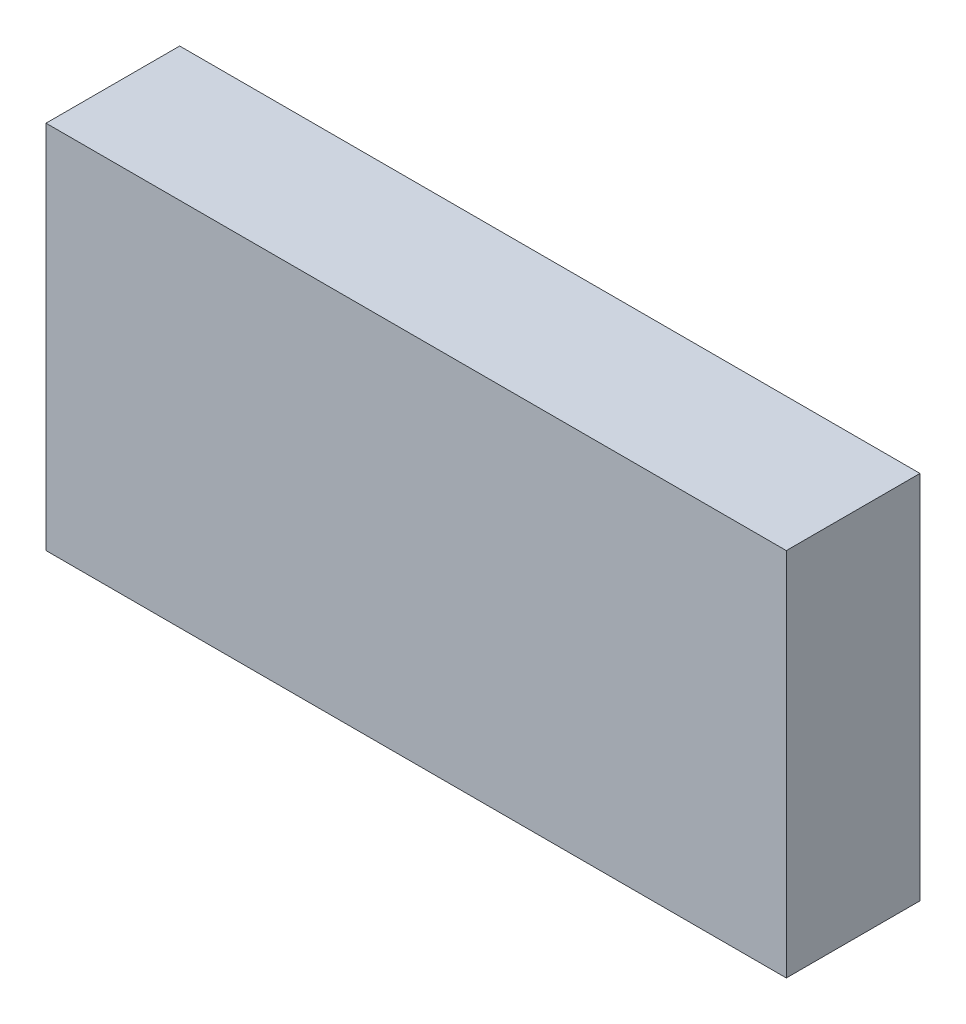
ISO-10303-21;
HEADER;
FILE_DESCRIPTION(('STEP AP214'),'2;1');
FILE_NAME('part.step','',(''),(''),'','','');
FILE_SCHEMA(('AUTOMOTIVE_DESIGN { 1 0 10303 214 1 1 1 1 }'));
ENDSEC;
DATA;
#1=APPLICATION_CONTEXT('core data for automotive mechanical design processes');
#2=APPLICATION_PROTOCOL_DEFINITION('international standard','automotive_design',2000,#1);
#3=PRODUCT_CONTEXT('',#1,'mechanical');
#4=PRODUCT('Part','Part','',(#3));
#5=PRODUCT_RELATED_PRODUCT_CATEGORY('part','',(#4));
#6=PRODUCT_DEFINITION_FORMATION('','',#4);
#7=PRODUCT_DEFINITION_CONTEXT('part definition',#1,'design');
#8=PRODUCT_DEFINITION('design','',#6,#7);
#9=PRODUCT_DEFINITION_SHAPE('','',#8);
#10=(LENGTH_UNIT() NAMED_UNIT(*) SI_UNIT(.MILLI.,.METRE.));
#11=(NAMED_UNIT(*) PLANE_ANGLE_UNIT() SI_UNIT($,.RADIAN.));
#12=(NAMED_UNIT(*) SI_UNIT($,.STERADIAN.) SOLID_ANGLE_UNIT());
#13=UNCERTAINTY_MEASURE_WITH_UNIT(LENGTH_MEASURE(1.E-05),#10,'distance_accuracy_value','');
#14=(GEOMETRIC_REPRESENTATION_CONTEXT(3) GLOBAL_UNCERTAINTY_ASSIGNED_CONTEXT((#13)) GLOBAL_UNIT_ASSIGNED_CONTEXT((#10,
#11,#12)) REPRESENTATION_CONTEXT('',''));
#15=CARTESIAN_POINT('',(0.,0.,0.));
#16=DIRECTION('',(0.,0.,1.));
#17=DIRECTION('',(1.,0.,0.));
#18=AXIS2_PLACEMENT_3D('',#15,#16,#17);
#19=CARTESIAN_POINT('',(36.,18.,13.));
#20=DIRECTION('',(-1.,0.,0.));
#21=DIRECTION('',(0.,-1.,0.));
#22=AXIS2_PLACEMENT_3D('',#19,#20,#21);
#23=PLANE('',#22);
#24=DIRECTION('',(0.,1.,0.));
#25=VECTOR('',#24,1.);
#26=CARTESIAN_POINT('',(36.,18.,0.));
#27=LINE('',#26,#25);
#28=CARTESIAN_POINT('',(36.,-18.,0.));
#29=VERTEX_POINT('',#28);
#30=CARTESIAN_POINT('',(36.,18.,0.));
#31=VERTEX_POINT('',#30);
#32=EDGE_CURVE('E111',#29,#31,#27,.T.);
#33=ORIENTED_EDGE('',*,*,#32,.T.);
#34=DIRECTION('',(0.,0.,-1.));
#35=VECTOR('',#34,1.);
#36=CARTESIAN_POINT('',(36.,18.,13.));
#37=LINE('',#36,#35);
#38=CARTESIAN_POINT('',(36.,18.,13.));
#39=VERTEX_POINT('',#38);
#40=EDGE_CURVE('E11',#39,#31,#37,.T.);
#41=ORIENTED_EDGE('',*,*,#40,.F.);
#42=DIRECTION('',(0.,1.,0.));
#43=VECTOR('',#42,1.);
#44=CARTESIAN_POINT('',(36.,18.,13.));
#45=LINE('',#44,#43);
#46=CARTESIAN_POINT('',(36.,-18.,13.));
#47=VERTEX_POINT('',#46);
#48=EDGE_CURVE('E95',#47,#39,#45,.T.);
#49=ORIENTED_EDGE('',*,*,#48,.F.);
#50=DIRECTION('',(0.,0.,-1.));
#51=VECTOR('',#50,1.);
#52=CARTESIAN_POINT('',(36.,-18.,13.));
#53=LINE('',#52,#51);
#54=EDGE_CURVE('E107',#47,#29,#53,.T.);
#55=ORIENTED_EDGE('',*,*,#54,.T.);
#56=EDGE_LOOP('',(#33,#41,#49,#55));
#57=FACE_BOUND('',#56,.T.);
#58=ADVANCED_FACE('F43',(#57),#23,.F.);
#59=CARTESIAN_POINT('',(-36.,18.,13.));
#60=DIRECTION('',(0.,-1.,0.));
#61=DIRECTION('',(0.,0.,-1.));
#62=AXIS2_PLACEMENT_3D('',#59,#60,#61);
#63=PLANE('',#62);
#64=DIRECTION('',(-1.,0.,0.));
#65=VECTOR('',#64,1.);
#66=CARTESIAN_POINT('',(-36.,18.,0.));
#67=LINE('',#66,#65);
#68=CARTESIAN_POINT('',(-36.,18.,0.));
#69=VERTEX_POINT('',#68);
#70=EDGE_CURVE('E100',#31,#69,#67,.T.);
#71=ORIENTED_EDGE('',*,*,#70,.T.);
#72=DIRECTION('',(0.,0.,-1.));
#73=VECTOR('',#72,1.);
#74=CARTESIAN_POINT('',(-36.,18.,13.));
#75=LINE('',#74,#73);
#76=CARTESIAN_POINT('',(-36.,18.,13.));
#77=VERTEX_POINT('',#76);
#78=EDGE_CURVE('E52',#77,#69,#75,.T.);
#79=ORIENTED_EDGE('',*,*,#78,.F.);
#80=DIRECTION('',(-1.,0.,0.));
#81=VECTOR('',#80,1.);
#82=CARTESIAN_POINT('',(-36.,18.,13.));
#83=LINE('',#82,#81);
#84=EDGE_CURVE('E90',#39,#77,#83,.T.);
#85=ORIENTED_EDGE('',*,*,#84,.F.);
#86=ORIENTED_EDGE('',*,*,#40,.T.);
#87=EDGE_LOOP('',(#71,#79,#85,#86));
#88=FACE_BOUND('',#87,.T.);
#89=ADVANCED_FACE('F99',(#88),#63,.F.);
#90=CARTESIAN_POINT('',(-36.,18.,13.));
#91=DIRECTION('',(1.,0.,0.));
#92=DIRECTION('',(0.,1.,0.));
#93=AXIS2_PLACEMENT_3D('',#90,#91,#92);
#94=PLANE('',#93);
#95=DIRECTION('',(0.,-1.,0.));
#96=VECTOR('',#95,1.);
#97=CARTESIAN_POINT('',(-36.,18.,0.));
#98=LINE('',#97,#96);
#99=CARTESIAN_POINT('',(-36.,-18.,0.));
#100=VERTEX_POINT('',#99);
#101=EDGE_CURVE('E77',#69,#100,#98,.T.);
#102=ORIENTED_EDGE('',*,*,#101,.T.);
#103=DIRECTION('',(0.,0.,-1.));
#104=VECTOR('',#103,1.);
#105=CARTESIAN_POINT('',(-36.,-18.,13.));
#106=LINE('',#105,#104);
#107=CARTESIAN_POINT('',(-36.,-18.,13.));
#108=VERTEX_POINT('',#107);
#109=EDGE_CURVE('E102',#108,#100,#106,.T.);
#110=ORIENTED_EDGE('',*,*,#109,.F.);
#111=DIRECTION('',(0.,-1.,0.));
#112=VECTOR('',#111,1.);
#113=CARTESIAN_POINT('',(-36.,18.,13.));
#114=LINE('',#113,#112);
#115=EDGE_CURVE('E93',#77,#108,#114,.T.);
#116=ORIENTED_EDGE('',*,*,#115,.F.);
#117=ORIENTED_EDGE('',*,*,#78,.T.);
#118=EDGE_LOOP('',(#102,#110,#116,#117));
#119=FACE_BOUND('',#118,.T.);
#120=ADVANCED_FACE('F103',(#119),#94,.F.);
#121=CARTESIAN_POINT('',(-36.,-18.,13.));
#122=DIRECTION('',(0.,1.,0.));
#123=DIRECTION('',(0.,0.,1.));
#124=AXIS2_PLACEMENT_3D('',#121,#122,#123);
#125=PLANE('',#124);
#126=DIRECTION('',(1.,0.,0.));
#127=VECTOR('',#126,1.);
#128=CARTESIAN_POINT('',(-36.,-18.,0.));
#129=LINE('',#128,#127);
#130=EDGE_CURVE('E83',#100,#29,#129,.T.);
#131=ORIENTED_EDGE('',*,*,#130,.T.);
#132=ORIENTED_EDGE('',*,*,#54,.F.);
#133=DIRECTION('',(1.,0.,0.));
#134=VECTOR('',#133,1.);
#135=CARTESIAN_POINT('',(-36.,-18.,13.));
#136=LINE('',#135,#134);
#137=EDGE_CURVE('E60',#108,#47,#136,.T.);
#138=ORIENTED_EDGE('',*,*,#137,.F.);
#139=ORIENTED_EDGE('',*,*,#109,.T.);
#140=EDGE_LOOP('',(#131,#132,#138,#139));
#141=FACE_BOUND('',#140,.T.);
#142=ADVANCED_FACE('F124',(#141),#125,.F.);
#143=CARTESIAN_POINT('',(0.,0.,13.));
#144=DIRECTION('',(0.,0.,1.));
#145=DIRECTION('',(1.,0.,0.));
#146=AXIS2_PLACEMENT_3D('',#143,#144,#145);
#147=PLANE('',#146);
#148=ORIENTED_EDGE('',*,*,#48,.T.);
#149=ORIENTED_EDGE('',*,*,#84,.T.);
#150=ORIENTED_EDGE('',*,*,#115,.T.);
#151=ORIENTED_EDGE('',*,*,#137,.T.);
#152=EDGE_LOOP('',(#148,#149,#150,#151));
#153=FACE_BOUND('',#152,.T.);
#154=ADVANCED_FACE('F91',(#153),#147,.T.);
#155=CARTESIAN_POINT('',(0.,0.,0.));
#156=DIRECTION('',(0.,0.,1.));
#157=DIRECTION('',(1.,0.,0.));
#158=AXIS2_PLACEMENT_3D('',#155,#156,#157);
#159=PLANE('',#158);
#160=ORIENTED_EDGE('',*,*,#32,.F.);
#161=ORIENTED_EDGE('',*,*,#130,.F.);
#162=ORIENTED_EDGE('',*,*,#101,.F.);
#163=ORIENTED_EDGE('',*,*,#70,.F.);
#164=EDGE_LOOP('',(#160,#161,#162,#163));
#165=FACE_BOUND('',#164,.T.);
#166=ADVANCED_FACE('F127',(#165),#159,.F.);
#167=CLOSED_SHELL('',(#58,#89,#120,#142,#154,#166));
#168=MANIFOLD_SOLID_BREP('B2',#167);
#169=ADVANCED_BREP_SHAPE_REPRESENTATION('',(#18,#168),#14);
#170=SHAPE_DEFINITION_REPRESENTATION(#9,#169);
ENDSEC;
END-ISO-10303-21;
